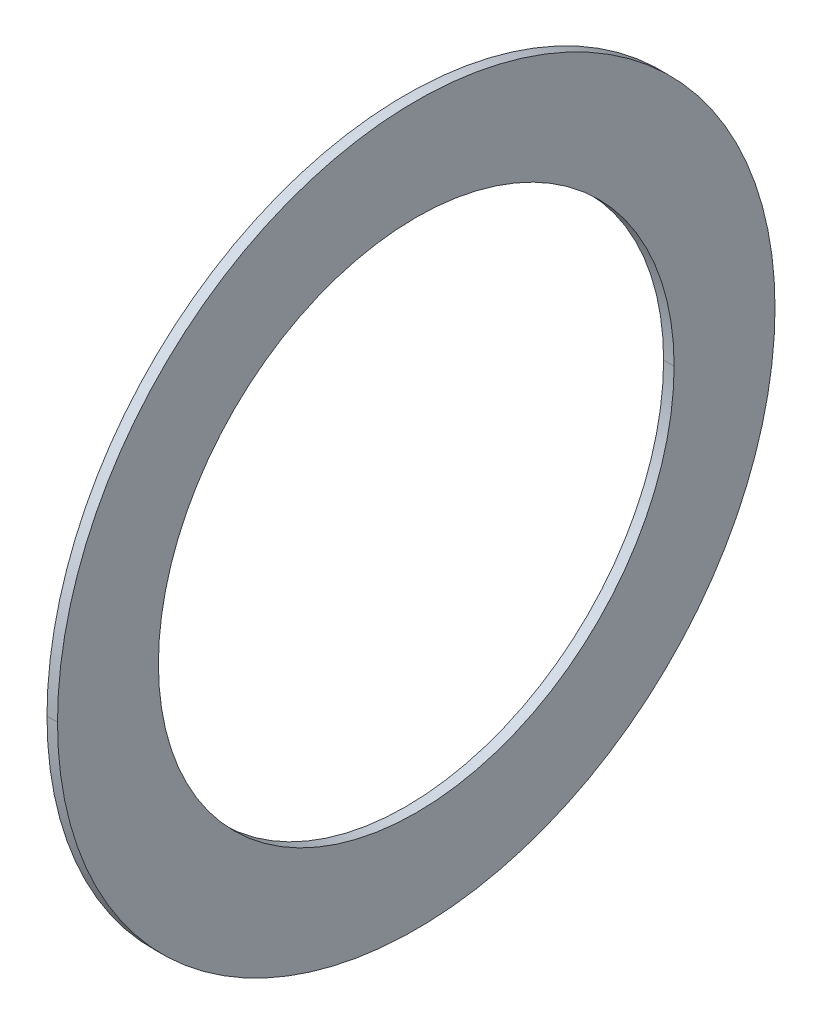
ISO-10303-21;
HEADER;
FILE_DESCRIPTION(('STEP AP214'),'2;1');
FILE_NAME('part.step','',(''),(''),'','','');
FILE_SCHEMA(('AUTOMOTIVE_DESIGN { 1 0 10303 214 1 1 1 1 }'));
ENDSEC;
DATA;
#1=APPLICATION_CONTEXT('core data for automotive mechanical design processes');
#2=APPLICATION_PROTOCOL_DEFINITION('international standard','automotive_design',2000,#1);
#3=PRODUCT_CONTEXT('',#1,'mechanical');
#4=PRODUCT('Part','Part','',(#3));
#5=PRODUCT_RELATED_PRODUCT_CATEGORY('part','',(#4));
#6=PRODUCT_DEFINITION_FORMATION('','',#4);
#7=PRODUCT_DEFINITION_CONTEXT('part definition',#1,'design');
#8=PRODUCT_DEFINITION('design','',#6,#7);
#9=PRODUCT_DEFINITION_SHAPE('','',#8);
#10=(LENGTH_UNIT() NAMED_UNIT(*) SI_UNIT(.MILLI.,.METRE.));
#11=(NAMED_UNIT(*) PLANE_ANGLE_UNIT() SI_UNIT($,.RADIAN.));
#12=(NAMED_UNIT(*) SI_UNIT($,.STERADIAN.) SOLID_ANGLE_UNIT());
#13=UNCERTAINTY_MEASURE_WITH_UNIT(LENGTH_MEASURE(1.E-05),#10,'distance_accuracy_value','');
#14=(GEOMETRIC_REPRESENTATION_CONTEXT(3) GLOBAL_UNCERTAINTY_ASSIGNED_CONTEXT((#13)) GLOBAL_UNIT_ASSIGNED_CONTEXT((#10,
#11,#12)) REPRESENTATION_CONTEXT('',''));
#15=CARTESIAN_POINT('',(0.,0.,0.));
#16=DIRECTION('',(0.,0.,1.));
#17=DIRECTION('',(1.,0.,0.));
#18=AXIS2_PLACEMENT_3D('',#15,#16,#17);
#19=CARTESIAN_POINT('',(0.25,6.4,0.));
#20=DIRECTION('',(-1.,0.,0.));
#21=DIRECTION('',(0.,0.,1.));
#22=AXIS2_PLACEMENT_3D('',#19,#20,#21);
#23=PLANE('',#22);
#24=CARTESIAN_POINT('',(0.25,0.,0.));
#25=DIRECTION('',(1.,0.,0.));
#26=DIRECTION('',(0.,0.,-1.));
#27=AXIS2_PLACEMENT_3D('',#24,#25,#26);
#28=CIRCLE('',#27,4.6);
#29=CARTESIAN_POINT('',(0.25,0.,-4.6));
#30=VERTEX_POINT('',#29);
#31=CARTESIAN_POINT('',(0.25,0.,4.6));
#32=VERTEX_POINT('',#31);
#33=EDGE_CURVE('E11',#30,#32,#28,.T.);
#34=ORIENTED_EDGE('',*,*,#33,.T.);
#35=CARTESIAN_POINT('',(0.25,0.,0.));
#36=DIRECTION('',(1.,0.,0.));
#37=DIRECTION('',(0.,0.,-1.));
#38=AXIS2_PLACEMENT_3D('',#35,#36,#37);
#39=CIRCLE('',#38,4.6);
#40=EDGE_CURVE('E25',#32,#30,#39,.T.);
#41=ORIENTED_EDGE('',*,*,#40,.T.);
#42=EDGE_LOOP('',(#34,#41));
#43=FACE_BOUND('',#42,.T.);
#44=CARTESIAN_POINT('',(0.25,0.,0.));
#45=DIRECTION('',(1.,0.,0.));
#46=DIRECTION('',(0.,0.,-1.));
#47=AXIS2_PLACEMENT_3D('',#44,#45,#46);
#48=CIRCLE('',#47,6.4);
#49=CARTESIAN_POINT('',(0.25,0.,-6.4));
#50=VERTEX_POINT('',#49);
#51=CARTESIAN_POINT('',(0.25,0.,6.4));
#52=VERTEX_POINT('',#51);
#53=EDGE_CURVE('E96',#50,#52,#48,.T.);
#54=ORIENTED_EDGE('',*,*,#53,.F.);
#55=CARTESIAN_POINT('',(0.25,0.,0.));
#56=DIRECTION('',(1.,0.,0.));
#57=DIRECTION('',(0.,0.,-1.));
#58=AXIS2_PLACEMENT_3D('',#55,#56,#57);
#59=CIRCLE('',#58,6.4);
#60=EDGE_CURVE('E91',#52,#50,#59,.T.);
#61=ORIENTED_EDGE('',*,*,#60,.F.);
#62=EDGE_LOOP('',(#54,#61));
#63=FACE_BOUND('',#62,.T.);
#64=ADVANCED_FACE('F17',(#43,#63),#23,.T.);
#65=CARTESIAN_POINT('',(0.4374,0.,0.));
#66=DIRECTION('',(-1.,0.,0.));
#67=DIRECTION('',(0.,1.,0.));
#68=AXIS2_PLACEMENT_3D('',#65,#66,#67);
#69=CYLINDRICAL_SURFACE('',#68,6.4);
#70=ORIENTED_EDGE('',*,*,#60,.T.);
#71=DIRECTION('',(-1.,0.,0.));
#72=VECTOR('',#71,1.);
#73=CARTESIAN_POINT('',(0.4374,0.,-6.4));
#74=LINE('',#73,#72);
#75=CARTESIAN_POINT('',(0.4374,0.,-6.4));
#76=VERTEX_POINT('',#75);
#77=EDGE_CURVE('E86',#76,#50,#74,.T.);
#78=ORIENTED_EDGE('',*,*,#77,.F.);
#79=CARTESIAN_POINT('',(0.4374,0.,0.));
#80=DIRECTION('',(1.,0.,0.));
#81=DIRECTION('',(0.,0.,-1.));
#82=AXIS2_PLACEMENT_3D('',#79,#80,#81);
#83=CIRCLE('',#82,6.4);
#84=CARTESIAN_POINT('',(0.4374,0.,6.4));
#85=VERTEX_POINT('',#84);
#86=EDGE_CURVE('E81',#85,#76,#83,.T.);
#87=ORIENTED_EDGE('',*,*,#86,.F.);
#88=DIRECTION('',(-1.,0.,0.));
#89=VECTOR('',#88,1.);
#90=CARTESIAN_POINT('',(0.4374,0.,6.4));
#91=LINE('',#90,#89);
#92=EDGE_CURVE('E70',#85,#52,#91,.T.);
#93=ORIENTED_EDGE('',*,*,#92,.T.);
#94=EDGE_LOOP('',(#70,#78,#87,#93));
#95=FACE_BOUND('',#94,.T.);
#96=ADVANCED_FACE('F111',(#95),#69,.T.);
#97=CARTESIAN_POINT('',(0.4374,0.,0.));
#98=DIRECTION('',(-1.,0.,0.));
#99=DIRECTION('',(0.,-1.,0.));
#100=AXIS2_PLACEMENT_3D('',#97,#98,#99);
#101=CYLINDRICAL_SURFACE('',#100,6.4);
#102=CARTESIAN_POINT('',(0.4374,0.,0.));
#103=DIRECTION('',(1.,0.,0.));
#104=DIRECTION('',(0.,0.,-1.));
#105=AXIS2_PLACEMENT_3D('',#102,#103,#104);
#106=CIRCLE('',#105,6.4);
#107=EDGE_CURVE('E67',#76,#85,#106,.T.);
#108=ORIENTED_EDGE('',*,*,#107,.F.);
#109=ORIENTED_EDGE('',*,*,#77,.T.);
#110=ORIENTED_EDGE('',*,*,#53,.T.);
#111=ORIENTED_EDGE('',*,*,#92,.F.);
#112=EDGE_LOOP('',(#108,#109,#110,#111));
#113=FACE_BOUND('',#112,.T.);
#114=ADVANCED_FACE('F108',(#113),#101,.T.);
#115=CARTESIAN_POINT('',(0.4374,4.6,0.));
#116=DIRECTION('',(1.,0.,0.));
#117=DIRECTION('',(0.,0.,-1.));
#118=AXIS2_PLACEMENT_3D('',#115,#116,#117);
#119=PLANE('',#118);
#120=ORIENTED_EDGE('',*,*,#107,.T.);
#121=ORIENTED_EDGE('',*,*,#86,.T.);
#122=EDGE_LOOP('',(#120,#121));
#123=FACE_BOUND('',#122,.T.);
#124=CARTESIAN_POINT('',(0.4374,0.,0.));
#125=DIRECTION('',(1.,0.,0.));
#126=DIRECTION('',(0.,0.,-1.));
#127=AXIS2_PLACEMENT_3D('',#124,#125,#126);
#128=CIRCLE('',#127,4.6);
#129=CARTESIAN_POINT('',(0.4374,0.,-4.6));
#130=VERTEX_POINT('',#129);
#131=CARTESIAN_POINT('',(0.4374,0.,4.6));
#132=VERTEX_POINT('',#131);
#133=EDGE_CURVE('E56',#130,#132,#128,.T.);
#134=ORIENTED_EDGE('',*,*,#133,.F.);
#135=CARTESIAN_POINT('',(0.4374,0.,0.));
#136=DIRECTION('',(1.,0.,0.));
#137=DIRECTION('',(0.,0.,-1.));
#138=AXIS2_PLACEMENT_3D('',#135,#136,#137);
#139=CIRCLE('',#138,4.6);
#140=EDGE_CURVE('E52',#132,#130,#139,.T.);
#141=ORIENTED_EDGE('',*,*,#140,.F.);
#142=EDGE_LOOP('',(#134,#141));
#143=FACE_BOUND('',#142,.T.);
#144=ADVANCED_FACE('F54',(#123,#143),#119,.T.);
#145=CARTESIAN_POINT('',(0.4374,0.,0.));
#146=DIRECTION('',(-1.,0.,0.));
#147=DIRECTION('',(0.,1.,0.));
#148=AXIS2_PLACEMENT_3D('',#145,#146,#147);
#149=CYLINDRICAL_SURFACE('',#148,4.6);
#150=ORIENTED_EDGE('',*,*,#40,.F.);
#151=DIRECTION('',(-1.,0.,0.));
#152=VECTOR('',#151,1.);
#153=CARTESIAN_POINT('',(0.4374,0.,4.6));
#154=LINE('',#153,#152);
#155=EDGE_CURVE('E59',#132,#32,#154,.T.);
#156=ORIENTED_EDGE('',*,*,#155,.F.);
#157=ORIENTED_EDGE('',*,*,#140,.T.);
#158=DIRECTION('',(-1.,0.,0.));
#159=VECTOR('',#158,1.);
#160=CARTESIAN_POINT('',(0.4374,0.,-4.6));
#161=LINE('',#160,#159);
#162=EDGE_CURVE('E64',#130,#30,#161,.T.);
#163=ORIENTED_EDGE('',*,*,#162,.T.);
#164=EDGE_LOOP('',(#150,#156,#157,#163));
#165=FACE_BOUND('',#164,.T.);
#166=ADVANCED_FACE('F62',(#165),#149,.F.);
#167=CARTESIAN_POINT('',(0.4374,0.,0.));
#168=DIRECTION('',(-1.,0.,0.));
#169=DIRECTION('',(0.,-1.,0.));
#170=AXIS2_PLACEMENT_3D('',#167,#168,#169);
#171=CYLINDRICAL_SURFACE('',#170,4.6);
#172=ORIENTED_EDGE('',*,*,#133,.T.);
#173=ORIENTED_EDGE('',*,*,#155,.T.);
#174=ORIENTED_EDGE('',*,*,#33,.F.);
#175=ORIENTED_EDGE('',*,*,#162,.F.);
#176=EDGE_LOOP('',(#172,#173,#174,#175));
#177=FACE_BOUND('',#176,.T.);
#178=ADVANCED_FACE('F66',(#177),#171,.F.);
#179=CLOSED_SHELL('',(#64,#96,#114,#144,#166,#178));
#180=MANIFOLD_SOLID_BREP('B1',#179);
#181=ADVANCED_BREP_SHAPE_REPRESENTATION('',(#18,#180),#14);
#182=SHAPE_DEFINITION_REPRESENTATION(#9,#181);
ENDSEC;
END-ISO-10303-21;
